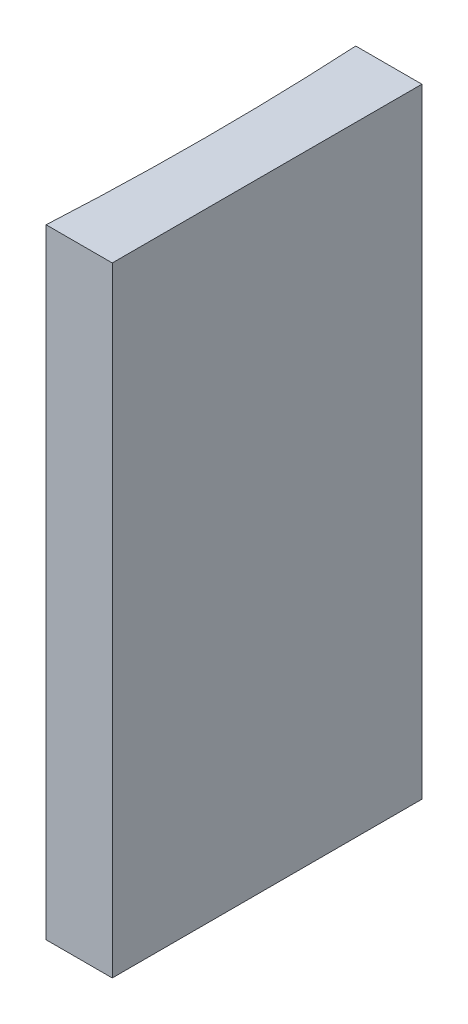
ISO-10303-21;
HEADER;
FILE_DESCRIPTION(('STEP AP214'),'2;1');
FILE_NAME('part.step','',(''),(''),'','','');
FILE_SCHEMA(('AUTOMOTIVE_DESIGN { 1 0 10303 214 1 1 1 1 }'));
ENDSEC;
DATA;
#1=APPLICATION_CONTEXT('core data for automotive mechanical design processes');
#2=APPLICATION_PROTOCOL_DEFINITION('international standard','automotive_design',2000,#1);
#3=PRODUCT_CONTEXT('',#1,'mechanical');
#4=PRODUCT('Part','Part','',(#3));
#5=PRODUCT_RELATED_PRODUCT_CATEGORY('part','',(#4));
#6=PRODUCT_DEFINITION_FORMATION('','',#4);
#7=PRODUCT_DEFINITION_CONTEXT('part definition',#1,'design');
#8=PRODUCT_DEFINITION('design','',#6,#7);
#9=PRODUCT_DEFINITION_SHAPE('','',#8);
#10=(LENGTH_UNIT() NAMED_UNIT(*) SI_UNIT(.MILLI.,.METRE.));
#11=(NAMED_UNIT(*) PLANE_ANGLE_UNIT() SI_UNIT($,.RADIAN.));
#12=(NAMED_UNIT(*) SI_UNIT($,.STERADIAN.) SOLID_ANGLE_UNIT());
#13=UNCERTAINTY_MEASURE_WITH_UNIT(LENGTH_MEASURE(1.E-05),#10,'distance_accuracy_value','');
#14=(GEOMETRIC_REPRESENTATION_CONTEXT(3) GLOBAL_UNCERTAINTY_ASSIGNED_CONTEXT((#13)) GLOBAL_UNIT_ASSIGNED_CONTEXT((#10,
#11,#12)) REPRESENTATION_CONTEXT('',''));
#15=CARTESIAN_POINT('',(0.,0.,0.));
#16=DIRECTION('',(0.,0.,1.));
#17=DIRECTION('',(1.,0.,0.));
#18=AXIS2_PLACEMENT_3D('',#15,#16,#17);
#19=CARTESIAN_POINT('',(0.,20.,0.));
#20=DIRECTION('',(0.,0.,1.));
#21=DIRECTION('',(1.,0.,0.));
#22=AXIS2_PLACEMENT_3D('',#19,#20,#21);
#23=PLANE('',#22);
#24=DIRECTION('',(-1.,0.,0.));
#25=VECTOR('',#24,1.);
#26=CARTESIAN_POINT('',(0.,0.,0.));
#27=LINE('',#26,#25);
#28=CARTESIAN_POINT('',(0.,0.,0.));
#29=VERTEX_POINT('',#28);
#30=CARTESIAN_POINT('',(-2.13641553543242,0.,0.));
#31=VERTEX_POINT('',#30);
#32=EDGE_CURVE('E100',#29,#31,#27,.T.);
#33=ORIENTED_EDGE('',*,*,#32,.T.);
#34=DIRECTION('',(0.,-1.,0.));
#35=VECTOR('',#34,1.);
#36=CARTESIAN_POINT('',(-2.13641553543242,20.,0.));
#37=LINE('',#36,#35);
#38=CARTESIAN_POINT('',(-2.13641553543242,20.,0.));
#39=VERTEX_POINT('',#38);
#40=EDGE_CURVE('E11',#39,#31,#37,.T.);
#41=ORIENTED_EDGE('',*,*,#40,.F.);
#42=DIRECTION('',(-1.,0.,0.));
#43=VECTOR('',#42,1.);
#44=CARTESIAN_POINT('',(0.,20.,0.));
#45=LINE('',#44,#43);
#46=CARTESIAN_POINT('',(0.,20.,0.));
#47=VERTEX_POINT('',#46);
#48=EDGE_CURVE('E88',#47,#39,#45,.T.);
#49=ORIENTED_EDGE('',*,*,#48,.F.);
#50=DIRECTION('',(0.,-1.,0.));
#51=VECTOR('',#50,1.);
#52=CARTESIAN_POINT('',(0.,20.,0.));
#53=LINE('',#52,#51);
#54=EDGE_CURVE('E96',#47,#29,#53,.T.);
#55=ORIENTED_EDGE('',*,*,#54,.T.);
#56=EDGE_LOOP('',(#33,#41,#49,#55));
#57=FACE_BOUND('',#56,.T.);
#58=ADVANCED_FACE('F37',(#57),#23,.F.);
#59=CARTESIAN_POINT('',(-93.7,20.,5.00000000000001));
#60=DIRECTION('',(0.,-1.,0.));
#61=DIRECTION('',(0.,0.,-1.));
#62=AXIS2_PLACEMENT_3D('',#59,#60,#61);
#63=CYLINDRICAL_SURFACE('',#62,91.7);
#64=CARTESIAN_POINT('',(-93.7,0.,5.00000000000001));
#65=DIRECTION('',(0.,-1.,0.));
#66=DIRECTION('',(0.,0.,1.));
#67=AXIS2_PLACEMENT_3D('',#64,#65,#66);
#68=CIRCLE('',#67,91.7);
#69=CARTESIAN_POINT('',(-2.13641553543242,0.,10.));
#70=VERTEX_POINT('',#69);
#71=EDGE_CURVE('E92',#31,#70,#68,.T.);
#72=ORIENTED_EDGE('',*,*,#71,.T.);
#73=DIRECTION('',(0.,-1.,0.));
#74=VECTOR('',#73,1.);
#75=CARTESIAN_POINT('',(-2.13641553543242,20.,10.));
#76=LINE('',#75,#74);
#77=CARTESIAN_POINT('',(-2.13641553543242,20.,10.));
#78=VERTEX_POINT('',#77);
#79=EDGE_CURVE('E45',#78,#70,#76,.T.);
#80=ORIENTED_EDGE('',*,*,#79,.F.);
#81=CARTESIAN_POINT('',(-93.7,20.,5.00000000000001));
#82=DIRECTION('',(0.,-1.,0.));
#83=DIRECTION('',(0.,0.,1.));
#84=AXIS2_PLACEMENT_3D('',#81,#82,#83);
#85=CIRCLE('',#84,91.7);
#86=EDGE_CURVE('E83',#39,#78,#85,.T.);
#87=ORIENTED_EDGE('',*,*,#86,.F.);
#88=ORIENTED_EDGE('',*,*,#40,.T.);
#89=EDGE_LOOP('',(#72,#80,#87,#88));
#90=FACE_BOUND('',#89,.T.);
#91=ADVANCED_FACE('F91',(#90),#63,.F.);
#92=CARTESIAN_POINT('',(0.,20.,10.));
#93=DIRECTION('',(0.,0.,-1.));
#94=DIRECTION('',(-1.,0.,0.));
#95=AXIS2_PLACEMENT_3D('',#92,#93,#94);
#96=PLANE('',#95);
#97=DIRECTION('',(1.,0.,0.));
#98=VECTOR('',#97,1.);
#99=CARTESIAN_POINT('',(0.,0.,10.));
#100=LINE('',#99,#98);
#101=CARTESIAN_POINT('',(0.,0.,10.));
#102=VERTEX_POINT('',#101);
#103=EDGE_CURVE('E70',#70,#102,#100,.T.);
#104=ORIENTED_EDGE('',*,*,#103,.T.);
#105=DIRECTION('',(0.,-1.,0.));
#106=VECTOR('',#105,1.);
#107=CARTESIAN_POINT('',(0.,20.,10.));
#108=LINE('',#107,#106);
#109=CARTESIAN_POINT('',(0.,20.,10.));
#110=VERTEX_POINT('',#109);
#111=EDGE_CURVE('E93',#110,#102,#108,.T.);
#112=ORIENTED_EDGE('',*,*,#111,.F.);
#113=DIRECTION('',(1.,0.,0.));
#114=VECTOR('',#113,1.);
#115=CARTESIAN_POINT('',(0.,20.,10.));
#116=LINE('',#115,#114);
#117=EDGE_CURVE('E86',#78,#110,#116,.T.);
#118=ORIENTED_EDGE('',*,*,#117,.F.);
#119=ORIENTED_EDGE('',*,*,#79,.T.);
#120=EDGE_LOOP('',(#104,#112,#118,#119));
#121=FACE_BOUND('',#120,.T.);
#122=ADVANCED_FACE('F94',(#121),#96,.F.);
#123=CARTESIAN_POINT('',(0.,20.,0.));
#124=DIRECTION('',(-1.,0.,0.));
#125=DIRECTION('',(0.,0.,1.));
#126=AXIS2_PLACEMENT_3D('',#123,#124,#125);
#127=PLANE('',#126);
#128=DIRECTION('',(0.,0.,-1.));
#129=VECTOR('',#128,1.);
#130=CARTESIAN_POINT('',(0.,0.,0.));
#131=LINE('',#130,#129);
#132=EDGE_CURVE('E76',#102,#29,#131,.T.);
#133=ORIENTED_EDGE('',*,*,#132,.T.);
#134=ORIENTED_EDGE('',*,*,#54,.F.);
#135=DIRECTION('',(0.,0.,-1.));
#136=VECTOR('',#135,1.);
#137=CARTESIAN_POINT('',(0.,20.,0.));
#138=LINE('',#137,#136);
#139=EDGE_CURVE('E53',#110,#47,#138,.T.);
#140=ORIENTED_EDGE('',*,*,#139,.F.);
#141=ORIENTED_EDGE('',*,*,#111,.T.);
#142=EDGE_LOOP('',(#133,#134,#140,#141));
#143=FACE_BOUND('',#142,.T.);
#144=ADVANCED_FACE('F107',(#143),#127,.F.);
#145=CARTESIAN_POINT('',(-93.7,20.,5.00000000000001));
#146=DIRECTION('',(0.,1.,0.));
#147=DIRECTION('',(0.,0.,1.));
#148=AXIS2_PLACEMENT_3D('',#145,#146,#147);
#149=PLANE('',#148);
#150=ORIENTED_EDGE('',*,*,#48,.T.);
#151=ORIENTED_EDGE('',*,*,#86,.T.);
#152=ORIENTED_EDGE('',*,*,#117,.T.);
#153=ORIENTED_EDGE('',*,*,#139,.T.);
#154=EDGE_LOOP('',(#150,#151,#152,#153));
#155=FACE_BOUND('',#154,.T.);
#156=ADVANCED_FACE('F84',(#155),#149,.T.);
#157=CARTESIAN_POINT('',(-93.7,0.,5.00000000000001));
#158=DIRECTION('',(0.,1.,0.));
#159=DIRECTION('',(0.,0.,1.));
#160=AXIS2_PLACEMENT_3D('',#157,#158,#159);
#161=PLANE('',#160);
#162=ORIENTED_EDGE('',*,*,#32,.F.);
#163=ORIENTED_EDGE('',*,*,#132,.F.);
#164=ORIENTED_EDGE('',*,*,#103,.F.);
#165=ORIENTED_EDGE('',*,*,#71,.F.);
#166=EDGE_LOOP('',(#162,#163,#164,#165));
#167=FACE_BOUND('',#166,.T.);
#168=ADVANCED_FACE('F110',(#167),#161,.F.);
#169=CLOSED_SHELL('',(#58,#91,#122,#144,#156,#168));
#170=MANIFOLD_SOLID_BREP('B2',#169);
#171=ADVANCED_BREP_SHAPE_REPRESENTATION('',(#18,#170),#14);
#172=SHAPE_DEFINITION_REPRESENTATION(#9,#171);
ENDSEC;
END-ISO-10303-21;
